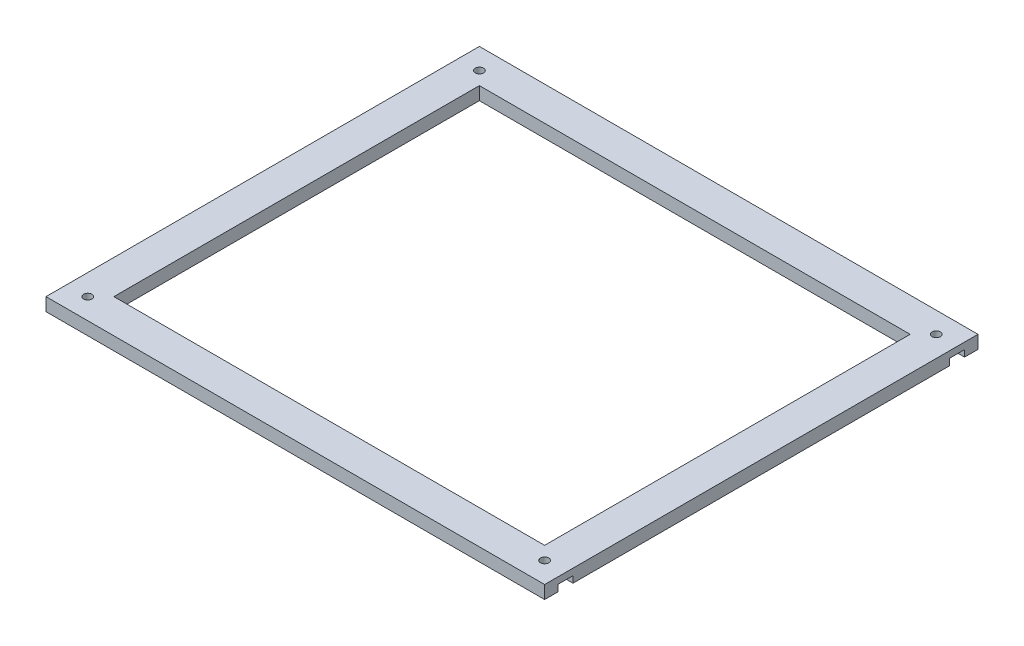
ISO-10303-21;
HEADER;
FILE_DESCRIPTION(('STEP AP214'),'2;1');
FILE_NAME('part.step','',(''),(''),'','','');
FILE_SCHEMA(('AUTOMOTIVE_DESIGN { 1 0 10303 214 1 1 1 1 }'));
ENDSEC;
DATA;
#1=APPLICATION_CONTEXT('core data for automotive mechanical design processes');
#2=APPLICATION_PROTOCOL_DEFINITION('international standard','automotive_design',2000,#1);
#3=PRODUCT_CONTEXT('',#1,'mechanical');
#4=PRODUCT('Part','Part','',(#3));
#5=PRODUCT_RELATED_PRODUCT_CATEGORY('part','',(#4));
#6=PRODUCT_DEFINITION_FORMATION('','',#4);
#7=PRODUCT_DEFINITION_CONTEXT('part definition',#1,'design');
#8=PRODUCT_DEFINITION('design','',#6,#7);
#9=PRODUCT_DEFINITION_SHAPE('','',#8);
#10=(LENGTH_UNIT() NAMED_UNIT(*) SI_UNIT(.MILLI.,.METRE.));
#11=(NAMED_UNIT(*) PLANE_ANGLE_UNIT() SI_UNIT($,.RADIAN.));
#12=(NAMED_UNIT(*) SI_UNIT($,.STERADIAN.) SOLID_ANGLE_UNIT());
#13=UNCERTAINTY_MEASURE_WITH_UNIT(LENGTH_MEASURE(1.E-05),#10,'distance_accuracy_value','');
#14=(GEOMETRIC_REPRESENTATION_CONTEXT(3) GLOBAL_UNCERTAINTY_ASSIGNED_CONTEXT((#13)) GLOBAL_UNIT_ASSIGNED_CONTEXT((#10,
#11,#12)) REPRESENTATION_CONTEXT('',''));
#15=CARTESIAN_POINT('',(0.,0.,0.));
#16=DIRECTION('',(0.,0.,1.));
#17=DIRECTION('',(1.,0.,0.));
#18=AXIS2_PLACEMENT_3D('',#15,#16,#17);
#19=CARTESIAN_POINT('',(1.31318109767508E-12,-5.,77.8499999999986));
#20=DIRECTION('',(0.,0.,-1.));
#21=DIRECTION('',(-1.,0.,0.));
#22=AXIS2_PLACEMENT_3D('',#19,#20,#21);
#23=PLANE('',#22);
#24=DIRECTION('',(0.,1.,0.));
#25=VECTOR('',#24,1.);
#26=CARTESIAN_POINT('',(-95.5,-5.,77.85));
#27=LINE('',#26,#25);
#28=CARTESIAN_POINT('',(-95.5,-5.,77.85));
#29=VERTEX_POINT('',#28);
#30=CARTESIAN_POINT('',(-95.5,-2.5,77.85));
#31=VERTEX_POINT('',#30);
#32=EDGE_CURVE('E50',#29,#31,#27,.T.);
#33=ORIENTED_EDGE('',*,*,#32,.T.);
#34=DIRECTION('',(-1.,0.,0.));
#35=VECTOR('',#34,1.);
#36=CARTESIAN_POINT('',(1.31318109767508E-12,-2.5,77.8499999999986));
#37=LINE('',#36,#35);
#38=CARTESIAN_POINT('',(-85.8545517328096,-2.5,77.85));
#39=VERTEX_POINT('',#38);
#40=EDGE_CURVE('E238',#39,#31,#37,.T.);
#41=ORIENTED_EDGE('',*,*,#40,.F.);
#42=DIRECTION('',(0.,1.,0.));
#43=VECTOR('',#42,1.);
#44=CARTESIAN_POINT('',(-85.8545517328096,-5.,77.85));
#45=LINE('',#44,#43);
#46=CARTESIAN_POINT('',(-85.8545517328096,-5.,77.85));
#47=VERTEX_POINT('',#46);
#48=EDGE_CURVE('E392',#47,#39,#45,.T.);
#49=ORIENTED_EDGE('',*,*,#48,.F.);
#50=DIRECTION('',(-1.,0.,0.));
#51=VECTOR('',#50,1.);
#52=CARTESIAN_POINT('',(1.31318109767508E-12,-5.,77.8499999999986));
#53=LINE('',#52,#51);
#54=EDGE_CURVE('E381',#47,#29,#53,.T.);
#55=ORIENTED_EDGE('',*,*,#54,.T.);
#56=EDGE_LOOP('',(#33,#41,#49,#55));
#57=FACE_BOUND('',#56,.T.);
#58=ADVANCED_FACE('F47',(#57),#23,.T.);
#59=CARTESIAN_POINT('',(-30.6808749572977,-5.,-17.7136114155692));
#60=DIRECTION('',(-0.866025403784438,0.,-0.500000000000002));
#61=DIRECTION('',(-0.500000000000002,0.,0.866025403784438));
#62=AXIS2_PLACEMENT_3D('',#59,#60,#61);
#63=PLANE('',#62);
#64=ORIENTED_EDGE('',*,*,#48,.T.);
#65=DIRECTION('',(-0.500000000000002,0.,0.866025403784438));
#66=VECTOR('',#65,1.);
#67=CARTESIAN_POINT('',(-30.6808749572977,-2.5,-17.7136114155692));
#68=LINE('',#67,#66);
#69=CARTESIAN_POINT('',(-84.2091034656192,-2.5,75.));
#70=VERTEX_POINT('',#69);
#71=EDGE_CURVE('E409',#70,#39,#68,.T.);
#72=ORIENTED_EDGE('',*,*,#71,.F.);
#73=DIRECTION('',(0.,1.,0.));
#74=VECTOR('',#73,1.);
#75=CARTESIAN_POINT('',(-84.2091034656192,-5.,75.));
#76=LINE('',#75,#74);
#77=CARTESIAN_POINT('',(-84.2091034656192,-5.,75.));
#78=VERTEX_POINT('',#77);
#79=EDGE_CURVE('E262',#78,#70,#76,.T.);
#80=ORIENTED_EDGE('',*,*,#79,.F.);
#81=DIRECTION('',(-0.500000000000002,0.,0.866025403784438));
#82=VECTOR('',#81,1.);
#83=CARTESIAN_POINT('',(-30.6808749572977,-5.,-17.7136114155692));
#84=LINE('',#83,#82);
#85=EDGE_CURVE('E408',#78,#47,#84,.T.);
#86=ORIENTED_EDGE('',*,*,#85,.T.);
#87=EDGE_LOOP('',(#64,#72,#80,#86));
#88=FACE_BOUND('',#87,.T.);
#89=ADVANCED_FACE('F407',(#88),#63,.T.);
#90=CARTESIAN_POINT('',(-95.6327802411308,-5.,55.2136114155692));
#91=DIRECTION('',(-0.866025403784438,0.,0.5));
#92=DIRECTION('',(0.5,0.,0.866025403784438));
#93=AXIS2_PLACEMENT_3D('',#90,#91,#92);
#94=PLANE('',#93);
#95=ORIENTED_EDGE('',*,*,#79,.T.);
#96=DIRECTION('',(0.5,0.,0.866025403784438));
#97=VECTOR('',#96,1.);
#98=CARTESIAN_POINT('',(-95.6327802411308,-2.5,55.2136114155692));
#99=LINE('',#98,#97);
#100=CARTESIAN_POINT('',(-85.8545517328096,-2.5,72.15));
#101=VERTEX_POINT('',#100);
#102=EDGE_CURVE('E400',#101,#70,#99,.T.);
#103=ORIENTED_EDGE('',*,*,#102,.F.);
#104=DIRECTION('',(0.,1.,0.));
#105=VECTOR('',#104,1.);
#106=CARTESIAN_POINT('',(-85.8545517328096,-5.,72.15));
#107=LINE('',#106,#105);
#108=CARTESIAN_POINT('',(-85.8545517328096,-5.,72.15));
#109=VERTEX_POINT('',#108);
#110=EDGE_CURVE('E251',#109,#101,#107,.T.);
#111=ORIENTED_EDGE('',*,*,#110,.F.);
#112=DIRECTION('',(0.5,0.,0.866025403784438));
#113=VECTOR('',#112,1.);
#114=CARTESIAN_POINT('',(-95.6327802411308,-5.,55.2136114155692));
#115=LINE('',#114,#113);
#116=EDGE_CURVE('E402',#109,#78,#115,.T.);
#117=ORIENTED_EDGE('',*,*,#116,.T.);
#118=EDGE_LOOP('',(#95,#103,#111,#117));
#119=FACE_BOUND('',#118,.T.);
#120=ADVANCED_FACE('F399',(#119),#94,.T.);
#121=CARTESIAN_POINT('',(0.,-5.,72.15));
#122=DIRECTION('',(0.,0.,-1.));
#123=DIRECTION('',(-1.,0.,0.));
#124=AXIS2_PLACEMENT_3D('',#121,#122,#123);
#125=PLANE('',#124);
#126=DIRECTION('',(1.,0.,0.));
#127=VECTOR('',#126,1.);
#128=CARTESIAN_POINT('',(0.,-2.5,72.15));
#129=LINE('',#128,#127);
#130=CARTESIAN_POINT('',(-95.5,-2.5,72.15));
#131=VERTEX_POINT('',#130);
#132=EDGE_CURVE('E235',#131,#101,#129,.T.);
#133=ORIENTED_EDGE('',*,*,#132,.F.);
#134=DIRECTION('',(0.,1.,0.));
#135=VECTOR('',#134,1.);
#136=CARTESIAN_POINT('',(-95.5,-5.,72.15));
#137=LINE('',#136,#135);
#138=CARTESIAN_POINT('',(-95.5,-5.,72.15));
#139=VERTEX_POINT('',#138);
#140=EDGE_CURVE('E249',#139,#131,#137,.T.);
#141=ORIENTED_EDGE('',*,*,#140,.F.);
#142=DIRECTION('',(-1.,0.,0.));
#143=VECTOR('',#142,1.);
#144=CARTESIAN_POINT('',(0.,-5.,72.15));
#145=LINE('',#144,#143);
#146=EDGE_CURVE('E559',#109,#139,#145,.T.);
#147=ORIENTED_EDGE('',*,*,#146,.F.);
#148=ORIENTED_EDGE('',*,*,#110,.T.);
#149=EDGE_LOOP('',(#133,#141,#147,#148));
#150=FACE_BOUND('',#149,.T.);
#151=ADVANCED_FACE('F247',(#150),#125,.F.);
#152=CARTESIAN_POINT('',(0.,-5.,-72.15));
#153=DIRECTION('',(0.,0.,1.));
#154=DIRECTION('',(1.,0.,0.));
#155=AXIS2_PLACEMENT_3D('',#152,#153,#154);
#156=PLANE('',#155);
#157=DIRECTION('',(1.,0.,0.));
#158=VECTOR('',#157,1.);
#159=CARTESIAN_POINT('',(0.,-2.5,-72.15));
#160=LINE('',#159,#158);
#161=CARTESIAN_POINT('',(-95.5,-2.5,-72.15));
#162=VERTEX_POINT('',#161);
#163=CARTESIAN_POINT('',(-85.8545517328096,-2.5,-72.15));
#164=VERTEX_POINT('',#163);
#165=EDGE_CURVE('E68',#162,#164,#160,.T.);
#166=ORIENTED_EDGE('',*,*,#165,.T.);
#167=DIRECTION('',(0.,1.,0.));
#168=VECTOR('',#167,1.);
#169=CARTESIAN_POINT('',(-85.8545517328096,-5.,-72.15));
#170=LINE('',#169,#168);
#171=CARTESIAN_POINT('',(-85.8545517328096,-5.,-72.15));
#172=VERTEX_POINT('',#171);
#173=EDGE_CURVE('E264',#172,#164,#170,.T.);
#174=ORIENTED_EDGE('',*,*,#173,.F.);
#175=DIRECTION('',(1.,0.,0.));
#176=VECTOR('',#175,1.);
#177=CARTESIAN_POINT('',(0.,-5.,-72.15));
#178=LINE('',#177,#176);
#179=CARTESIAN_POINT('',(-95.5,-5.,-72.15));
#180=VERTEX_POINT('',#179);
#181=EDGE_CURVE('E554',#180,#172,#178,.T.);
#182=ORIENTED_EDGE('',*,*,#181,.F.);
#183=DIRECTION('',(0.,1.,0.));
#184=VECTOR('',#183,1.);
#185=CARTESIAN_POINT('',(-95.5,-5.,-72.15));
#186=LINE('',#185,#184);
#187=EDGE_CURVE('E64',#180,#162,#186,.T.);
#188=ORIENTED_EDGE('',*,*,#187,.T.);
#189=EDGE_LOOP('',(#166,#174,#182,#188));
#190=FACE_BOUND('',#189,.T.);
#191=ADVANCED_FACE('F614',(#190),#156,.F.);
#192=CARTESIAN_POINT('',(-95.6327802411308,-5.,-55.2136114155692));
#193=DIRECTION('',(0.866025403784438,0.,0.5));
#194=DIRECTION('',(0.5,0.,-0.866025403784438));
#195=AXIS2_PLACEMENT_3D('',#192,#193,#194);
#196=PLANE('',#195);
#197=DIRECTION('',(0.5,0.,-0.866025403784438));
#198=VECTOR('',#197,1.);
#199=CARTESIAN_POINT('',(-95.6327802411308,-2.5,-55.2136114155692));
#200=LINE('',#199,#198);
#201=CARTESIAN_POINT('',(-84.2091034656192,-2.5,-75.));
#202=VERTEX_POINT('',#201);
#203=EDGE_CURVE('E485',#164,#202,#200,.T.);
#204=ORIENTED_EDGE('',*,*,#203,.T.);
#205=DIRECTION('',(0.,1.,0.));
#206=VECTOR('',#205,1.);
#207=CARTESIAN_POINT('',(-84.2091034656192,-5.,-75.));
#208=LINE('',#207,#206);
#209=CARTESIAN_POINT('',(-84.2091034656192,-5.,-75.));
#210=VERTEX_POINT('',#209);
#211=EDGE_CURVE('E270',#210,#202,#208,.T.);
#212=ORIENTED_EDGE('',*,*,#211,.F.);
#213=DIRECTION('',(0.5,0.,-0.866025403784438));
#214=VECTOR('',#213,1.);
#215=CARTESIAN_POINT('',(-95.6327802411308,-5.,-55.2136114155692));
#216=LINE('',#215,#214);
#217=EDGE_CURVE('E551',#172,#210,#216,.T.);
#218=ORIENTED_EDGE('',*,*,#217,.F.);
#219=ORIENTED_EDGE('',*,*,#173,.T.);
#220=EDGE_LOOP('',(#204,#212,#218,#219));
#221=FACE_BOUND('',#220,.T.);
#222=ADVANCED_FACE('F618',(#221),#196,.F.);
#223=CARTESIAN_POINT('',(-30.6808749572977,-5.,17.7136114155692));
#224=DIRECTION('',(0.866025403784438,0.,-0.500000000000002));
#225=DIRECTION('',(-0.500000000000002,0.,-0.866025403784438));
#226=AXIS2_PLACEMENT_3D('',#223,#224,#225);
#227=PLANE('',#226);
#228=DIRECTION('',(-0.500000000000002,0.,-0.866025403784438));
#229=VECTOR('',#228,1.);
#230=CARTESIAN_POINT('',(-30.6808749572977,-2.5,17.7136114155692));
#231=LINE('',#230,#229);
#232=CARTESIAN_POINT('',(-85.8545517328096,-2.5,-77.85));
#233=VERTEX_POINT('',#232);
#234=EDGE_CURVE('E358',#202,#233,#231,.T.);
#235=ORIENTED_EDGE('',*,*,#234,.T.);
#236=DIRECTION('',(0.,1.,0.));
#237=VECTOR('',#236,1.);
#238=CARTESIAN_POINT('',(-85.8545517328096,-5.,-77.85));
#239=LINE('',#238,#237);
#240=CARTESIAN_POINT('',(-85.8545517328096,-5.,-77.85));
#241=VERTEX_POINT('',#240);
#242=EDGE_CURVE('E274',#241,#233,#239,.T.);
#243=ORIENTED_EDGE('',*,*,#242,.F.);
#244=DIRECTION('',(-0.500000000000002,0.,-0.866025403784438));
#245=VECTOR('',#244,1.);
#246=CARTESIAN_POINT('',(-30.6808749572977,-5.,17.7136114155692));
#247=LINE('',#246,#245);
#248=EDGE_CURVE('E548',#210,#241,#247,.T.);
#249=ORIENTED_EDGE('',*,*,#248,.F.);
#250=ORIENTED_EDGE('',*,*,#211,.T.);
#251=EDGE_LOOP('',(#235,#243,#249,#250));
#252=FACE_BOUND('',#251,.T.);
#253=ADVANCED_FACE('F621',(#252),#227,.F.);
#254=CARTESIAN_POINT('',(0.,-5.,-77.85));
#255=DIRECTION('',(0.,0.,-1.));
#256=DIRECTION('',(-1.,0.,0.));
#257=AXIS2_PLACEMENT_3D('',#254,#255,#256);
#258=PLANE('',#257);
#259=DIRECTION('',(-1.,0.,0.));
#260=VECTOR('',#259,1.);
#261=CARTESIAN_POINT('',(0.,-2.5,-77.85));
#262=LINE('',#261,#260);
#263=CARTESIAN_POINT('',(-95.5,-2.5,-77.85));
#264=VERTEX_POINT('',#263);
#265=EDGE_CURVE('E476',#233,#264,#262,.T.);
#266=ORIENTED_EDGE('',*,*,#265,.T.);
#267=DIRECTION('',(0.,1.,0.));
#268=VECTOR('',#267,1.);
#269=CARTESIAN_POINT('',(-95.5,-5.,-77.85));
#270=LINE('',#269,#268);
#271=CARTESIAN_POINT('',(-95.5,-5.,-77.85));
#272=VERTEX_POINT('',#271);
#273=EDGE_CURVE('E278',#272,#264,#270,.T.);
#274=ORIENTED_EDGE('',*,*,#273,.F.);
#275=DIRECTION('',(-1.,0.,0.));
#276=VECTOR('',#275,1.);
#277=CARTESIAN_POINT('',(0.,-5.,-77.85));
#278=LINE('',#277,#276);
#279=EDGE_CURVE('E545',#241,#272,#278,.T.);
#280=ORIENTED_EDGE('',*,*,#279,.F.);
#281=ORIENTED_EDGE('',*,*,#242,.T.);
#282=EDGE_LOOP('',(#266,#274,#280,#281));
#283=FACE_BOUND('',#282,.T.);
#284=ADVANCED_FACE('F625',(#283),#258,.F.);
#285=CARTESIAN_POINT('',(0.,-5.,-77.85));
#286=DIRECTION('',(0.,0.,1.));
#287=DIRECTION('',(1.,0.,0.));
#288=AXIS2_PLACEMENT_3D('',#285,#286,#287);
#289=PLANE('',#288);
#290=DIRECTION('',(0.,1.,0.));
#291=VECTOR('',#290,1.);
#292=CARTESIAN_POINT('',(95.5,-5.,-77.85));
#293=LINE('',#292,#291);
#294=CARTESIAN_POINT('',(95.5,-5.,-77.85));
#295=VERTEX_POINT('',#294);
#296=CARTESIAN_POINT('',(95.5,-2.5,-77.85));
#297=VERTEX_POINT('',#296);
#298=EDGE_CURVE('E290',#295,#297,#293,.T.);
#299=ORIENTED_EDGE('',*,*,#298,.T.);
#300=DIRECTION('',(1.,0.,0.));
#301=VECTOR('',#300,1.);
#302=CARTESIAN_POINT('',(0.,-2.5,-77.85));
#303=LINE('',#302,#301);
#304=CARTESIAN_POINT('',(85.8545517328096,-2.5,-77.85));
#305=VERTEX_POINT('',#304);
#306=EDGE_CURVE('E457',#305,#297,#303,.T.);
#307=ORIENTED_EDGE('',*,*,#306,.F.);
#308=DIRECTION('',(0.,1.,0.));
#309=VECTOR('',#308,1.);
#310=CARTESIAN_POINT('',(85.8545517328096,-5.,-77.85));
#311=LINE('',#310,#309);
#312=CARTESIAN_POINT('',(85.8545517328096,-5.,-77.85));
#313=VERTEX_POINT('',#312);
#314=EDGE_CURVE('E294',#313,#305,#311,.T.);
#315=ORIENTED_EDGE('',*,*,#314,.F.);
#316=DIRECTION('',(1.,0.,0.));
#317=VECTOR('',#316,1.);
#318=CARTESIAN_POINT('',(0.,-5.,-77.85));
#319=LINE('',#318,#317);
#320=EDGE_CURVE('E531',#313,#295,#319,.T.);
#321=ORIENTED_EDGE('',*,*,#320,.T.);
#322=EDGE_LOOP('',(#299,#307,#315,#321));
#323=FACE_BOUND('',#322,.T.);
#324=ADVANCED_FACE('F629',(#323),#289,.T.);
#325=CARTESIAN_POINT('',(30.6808749572979,-5.,17.7136114155692));
#326=DIRECTION('',(0.866025403784439,0.,0.5));
#327=DIRECTION('',(0.5,0.,-0.866025403784439));
#328=AXIS2_PLACEMENT_3D('',#325,#326,#327);
#329=PLANE('',#328);
#330=ORIENTED_EDGE('',*,*,#314,.T.);
#331=DIRECTION('',(0.5,0.,-0.866025403784439));
#332=VECTOR('',#331,1.);
#333=CARTESIAN_POINT('',(30.6808749572979,-2.5,17.7136114155692));
#334=LINE('',#333,#332);
#335=CARTESIAN_POINT('',(84.2091034656192,-2.5,-75.));
#336=VERTEX_POINT('',#335);
#337=EDGE_CURVE('E460',#336,#305,#334,.T.);
#338=ORIENTED_EDGE('',*,*,#337,.F.);
#339=DIRECTION('',(0.,1.,0.));
#340=VECTOR('',#339,1.);
#341=CARTESIAN_POINT('',(84.2091034656192,-5.,-75.));
#342=LINE('',#341,#340);
#343=CARTESIAN_POINT('',(84.2091034656192,-5.,-75.));
#344=VERTEX_POINT('',#343);
#345=EDGE_CURVE('E298',#344,#336,#342,.T.);
#346=ORIENTED_EDGE('',*,*,#345,.F.);
#347=DIRECTION('',(0.5,0.,-0.866025403784439));
#348=VECTOR('',#347,1.);
#349=CARTESIAN_POINT('',(30.6808749572979,-5.,17.7136114155692));
#350=LINE('',#349,#348);
#351=EDGE_CURVE('E527',#344,#313,#350,.T.);
#352=ORIENTED_EDGE('',*,*,#351,.T.);
#353=EDGE_LOOP('',(#330,#338,#346,#352));
#354=FACE_BOUND('',#353,.T.);
#355=ADVANCED_FACE('F640',(#354),#329,.T.);
#356=CARTESIAN_POINT('',(95.6327802411307,-5.,-55.2136114155695));
#357=DIRECTION('',(0.866025403784437,0.,-0.500000000000002));
#358=DIRECTION('',(-0.500000000000002,0.,-0.866025403784437));
#359=AXIS2_PLACEMENT_3D('',#356,#357,#358);
#360=PLANE('',#359);
#361=ORIENTED_EDGE('',*,*,#345,.T.);
#362=DIRECTION('',(-0.500000000000002,0.,-0.866025403784437));
#363=VECTOR('',#362,1.);
#364=CARTESIAN_POINT('',(95.6327802411307,-2.5,-55.2136114155695));
#365=LINE('',#364,#363);
#366=CARTESIAN_POINT('',(85.8545517328096,-2.5,-72.15));
#367=VERTEX_POINT('',#366);
#368=EDGE_CURVE('E463',#367,#336,#365,.T.);
#369=ORIENTED_EDGE('',*,*,#368,.F.);
#370=DIRECTION('',(0.,1.,0.));
#371=VECTOR('',#370,1.);
#372=CARTESIAN_POINT('',(85.8545517328096,-5.,-72.15));
#373=LINE('',#372,#371);
#374=CARTESIAN_POINT('',(85.8545517328096,-5.,-72.15));
#375=VERTEX_POINT('',#374);
#376=EDGE_CURVE('E302',#375,#367,#373,.T.);
#377=ORIENTED_EDGE('',*,*,#376,.F.);
#378=DIRECTION('',(-0.500000000000002,0.,-0.866025403784437));
#379=VECTOR('',#378,1.);
#380=CARTESIAN_POINT('',(95.6327802411307,-5.,-55.2136114155695));
#381=LINE('',#380,#379);
#382=EDGE_CURVE('E523',#375,#344,#381,.T.);
#383=ORIENTED_EDGE('',*,*,#382,.T.);
#384=EDGE_LOOP('',(#361,#369,#377,#383));
#385=FACE_BOUND('',#384,.T.);
#386=ADVANCED_FACE('F644',(#385),#360,.T.);
#387=CARTESIAN_POINT('',(0.,-5.,-72.15));
#388=DIRECTION('',(0.,0.,1.));
#389=DIRECTION('',(1.,0.,0.));
#390=AXIS2_PLACEMENT_3D('',#387,#388,#389);
#391=PLANE('',#390);
#392=DIRECTION('',(-1.,0.,0.));
#393=VECTOR('',#392,1.);
#394=CARTESIAN_POINT('',(0.,-2.5,-72.15));
#395=LINE('',#394,#393);
#396=CARTESIAN_POINT('',(95.5,-2.5,-72.15));
#397=VERTEX_POINT('',#396);
#398=EDGE_CURVE('E450',#397,#367,#395,.T.);
#399=ORIENTED_EDGE('',*,*,#398,.F.);
#400=DIRECTION('',(0.,1.,0.));
#401=VECTOR('',#400,1.);
#402=CARTESIAN_POINT('',(95.5,-5.,-72.15));
#403=LINE('',#402,#401);
#404=CARTESIAN_POINT('',(95.5,-5.,-72.15));
#405=VERTEX_POINT('',#404);
#406=EDGE_CURVE('E306',#405,#397,#403,.T.);
#407=ORIENTED_EDGE('',*,*,#406,.F.);
#408=DIRECTION('',(1.,0.,0.));
#409=VECTOR('',#408,1.);
#410=CARTESIAN_POINT('',(0.,-5.,-72.15));
#411=LINE('',#410,#409);
#412=EDGE_CURVE('E520',#375,#405,#411,.T.);
#413=ORIENTED_EDGE('',*,*,#412,.F.);
#414=ORIENTED_EDGE('',*,*,#376,.T.);
#415=EDGE_LOOP('',(#399,#407,#413,#414));
#416=FACE_BOUND('',#415,.T.);
#417=ADVANCED_FACE('F648',(#416),#391,.F.);
#418=CARTESIAN_POINT('',(0.,-5.,72.15));
#419=DIRECTION('',(0.,0.,-1.));
#420=DIRECTION('',(-1.,0.,0.));
#421=AXIS2_PLACEMENT_3D('',#418,#419,#420);
#422=PLANE('',#421);
#423=DIRECTION('',(-1.,0.,0.));
#424=VECTOR('',#423,1.);
#425=CARTESIAN_POINT('',(0.,-2.5,72.15));
#426=LINE('',#425,#424);
#427=CARTESIAN_POINT('',(95.5,-2.5,72.15));
#428=VERTEX_POINT('',#427);
#429=CARTESIAN_POINT('',(85.8545517328096,-2.5,72.15));
#430=VERTEX_POINT('',#429);
#431=EDGE_CURVE('E438',#428,#430,#426,.T.);
#432=ORIENTED_EDGE('',*,*,#431,.T.);
#433=DIRECTION('',(0.,1.,0.));
#434=VECTOR('',#433,1.);
#435=CARTESIAN_POINT('',(85.8545517328096,-5.,72.15));
#436=LINE('',#435,#434);
#437=CARTESIAN_POINT('',(85.8545517328096,-5.,72.15));
#438=VERTEX_POINT('',#437);
#439=EDGE_CURVE('E313',#438,#430,#436,.T.);
#440=ORIENTED_EDGE('',*,*,#439,.F.);
#441=DIRECTION('',(-1.,0.,0.));
#442=VECTOR('',#441,1.);
#443=CARTESIAN_POINT('',(0.,-5.,72.15));
#444=LINE('',#443,#442);
#445=CARTESIAN_POINT('',(95.5,-5.,72.15));
#446=VERTEX_POINT('',#445);
#447=EDGE_CURVE('E514',#446,#438,#444,.T.);
#448=ORIENTED_EDGE('',*,*,#447,.F.);
#449=DIRECTION('',(0.,1.,0.));
#450=VECTOR('',#449,1.);
#451=CARTESIAN_POINT('',(95.5,-5.,72.15));
#452=LINE('',#451,#450);
#453=EDGE_CURVE('E310',#446,#428,#452,.T.);
#454=ORIENTED_EDGE('',*,*,#453,.T.);
#455=EDGE_LOOP('',(#432,#440,#448,#454));
#456=FACE_BOUND('',#455,.T.);
#457=ADVANCED_FACE('F652',(#456),#422,.F.);
#458=CARTESIAN_POINT('',(95.6327802411307,-5.,55.2136114155695));
#459=DIRECTION('',(-0.866025403784437,0.,-0.500000000000002));
#460=DIRECTION('',(-0.500000000000002,0.,0.866025403784437));
#461=AXIS2_PLACEMENT_3D('',#458,#459,#460);
#462=PLANE('',#461);
#463=DIRECTION('',(-0.500000000000002,0.,0.866025403784437));
#464=VECTOR('',#463,1.);
#465=CARTESIAN_POINT('',(95.6327802411307,-2.5,55.2136114155695));
#466=LINE('',#465,#464);
#467=CARTESIAN_POINT('',(84.2091034656192,-2.5,75.));
#468=VERTEX_POINT('',#467);
#469=EDGE_CURVE('E441',#430,#468,#466,.T.);
#470=ORIENTED_EDGE('',*,*,#469,.T.);
#471=DIRECTION('',(0.,1.,0.));
#472=VECTOR('',#471,1.);
#473=CARTESIAN_POINT('',(84.2091034656192,-5.,75.));
#474=LINE('',#473,#472);
#475=CARTESIAN_POINT('',(84.2091034656192,-5.,75.));
#476=VERTEX_POINT('',#475);
#477=EDGE_CURVE('E317',#476,#468,#474,.T.);
#478=ORIENTED_EDGE('',*,*,#477,.F.);
#479=DIRECTION('',(-0.500000000000002,0.,0.866025403784437));
#480=VECTOR('',#479,1.);
#481=CARTESIAN_POINT('',(95.6327802411307,-5.,55.2136114155695));
#482=LINE('',#481,#480);
#483=EDGE_CURVE('E511',#438,#476,#482,.T.);
#484=ORIENTED_EDGE('',*,*,#483,.F.);
#485=ORIENTED_EDGE('',*,*,#439,.T.);
#486=EDGE_LOOP('',(#470,#478,#484,#485));
#487=FACE_BOUND('',#486,.T.);
#488=ADVANCED_FACE('F656',(#487),#462,.F.);
#489=CARTESIAN_POINT('',(30.6808749572979,-5.,-17.7136114155692));
#490=DIRECTION('',(-0.866025403784439,0.,0.5));
#491=DIRECTION('',(0.5,0.,0.866025403784439));
#492=AXIS2_PLACEMENT_3D('',#489,#490,#491);
#493=PLANE('',#492);
#494=DIRECTION('',(0.5,0.,0.866025403784439));
#495=VECTOR('',#494,1.);
#496=CARTESIAN_POINT('',(30.6808749572979,-2.5,-17.7136114155692));
#497=LINE('',#496,#495);
#498=CARTESIAN_POINT('',(85.8545517328096,-2.5,77.85));
#499=VERTEX_POINT('',#498);
#500=EDGE_CURVE('E425',#468,#499,#497,.T.);
#501=ORIENTED_EDGE('',*,*,#500,.T.);
#502=DIRECTION('',(0.,1.,0.));
#503=VECTOR('',#502,1.);
#504=CARTESIAN_POINT('',(85.8545517328096,-5.,77.85));
#505=LINE('',#504,#503);
#506=CARTESIAN_POINT('',(85.8545517328096,-5.,77.85));
#507=VERTEX_POINT('',#506);
#508=EDGE_CURVE('E321',#507,#499,#505,.T.);
#509=ORIENTED_EDGE('',*,*,#508,.F.);
#510=DIRECTION('',(0.5,0.,0.866025403784439));
#511=VECTOR('',#510,1.);
#512=CARTESIAN_POINT('',(30.6808749572979,-5.,-17.7136114155692));
#513=LINE('',#512,#511);
#514=EDGE_CURVE('E508',#476,#507,#513,.T.);
#515=ORIENTED_EDGE('',*,*,#514,.F.);
#516=ORIENTED_EDGE('',*,*,#477,.T.);
#517=EDGE_LOOP('',(#501,#509,#515,#516));
#518=FACE_BOUND('',#517,.T.);
#519=ADVANCED_FACE('F660',(#518),#493,.F.);
#520=CARTESIAN_POINT('',(0.,-5.,77.85));
#521=DIRECTION('',(0.,0.,1.));
#522=DIRECTION('',(1.,0.,0.));
#523=AXIS2_PLACEMENT_3D('',#520,#521,#522);
#524=PLANE('',#523);
#525=DIRECTION('',(1.,0.,0.));
#526=VECTOR('',#525,1.);
#527=CARTESIAN_POINT('',(0.,-2.5,77.85));
#528=LINE('',#527,#526);
#529=CARTESIAN_POINT('',(95.5,-2.5,77.85));
#530=VERTEX_POINT('',#529);
#531=EDGE_CURVE('E430',#499,#530,#528,.T.);
#532=ORIENTED_EDGE('',*,*,#531,.T.);
#533=DIRECTION('',(0.,1.,0.));
#534=VECTOR('',#533,1.);
#535=CARTESIAN_POINT('',(95.5,-5.,77.85));
#536=LINE('',#535,#534);
#537=CARTESIAN_POINT('',(95.5,-5.,77.85));
#538=VERTEX_POINT('',#537);
#539=EDGE_CURVE('E325',#538,#530,#536,.T.);
#540=ORIENTED_EDGE('',*,*,#539,.F.);
#541=DIRECTION('',(1.,0.,0.));
#542=VECTOR('',#541,1.);
#543=CARTESIAN_POINT('',(0.,-5.,77.85));
#544=LINE('',#543,#542);
#545=EDGE_CURVE('E505',#507,#538,#544,.T.);
#546=ORIENTED_EDGE('',*,*,#545,.F.);
#547=ORIENTED_EDGE('',*,*,#508,.T.);
#548=EDGE_LOOP('',(#532,#540,#546,#547));
#549=FACE_BOUND('',#548,.T.);
#550=ADVANCED_FACE('F664',(#549),#524,.F.);
#551=CARTESIAN_POINT('',(82.5,-5.,0.));
#552=DIRECTION('',(1.,0.,0.));
#553=DIRECTION('',(0.,0.,-1.));
#554=AXIS2_PLACEMENT_3D('',#551,#552,#553);
#555=PLANE('',#554);
#556=DIRECTION('',(0.,0.,-1.));
#557=VECTOR('',#556,1.);
#558=CARTESIAN_POINT('',(82.5,0.,0.));
#559=LINE('',#558,#557);
#560=CARTESIAN_POINT('',(82.5,0.,70.));
#561=VERTEX_POINT('',#560);
#562=CARTESIAN_POINT('',(82.5,0.,-70.));
#563=VERTEX_POINT('',#562);
#564=EDGE_CURVE('E367',#561,#563,#559,.T.);
#565=ORIENTED_EDGE('',*,*,#564,.T.);
#566=DIRECTION('',(0.,1.,0.));
#567=VECTOR('',#566,1.);
#568=CARTESIAN_POINT('',(82.5,-5.,-70.));
#569=LINE('',#568,#567);
#570=CARTESIAN_POINT('',(82.5,-5.,-70.));
#571=VERTEX_POINT('',#570);
#572=EDGE_CURVE('E11',#571,#563,#569,.T.);
#573=ORIENTED_EDGE('',*,*,#572,.F.);
#574=DIRECTION('',(0.,0.,-1.));
#575=VECTOR('',#574,1.);
#576=CARTESIAN_POINT('',(82.5,-5.,0.));
#577=LINE('',#576,#575);
#578=CARTESIAN_POINT('',(82.5,-5.,70.));
#579=VERTEX_POINT('',#578);
#580=EDGE_CURVE('E566',#579,#571,#577,.T.);
#581=ORIENTED_EDGE('',*,*,#580,.F.);
#582=DIRECTION('',(0.,1.,0.));
#583=VECTOR('',#582,1.);
#584=CARTESIAN_POINT('',(82.5,-5.,70.));
#585=LINE('',#584,#583);
#586=EDGE_CURVE('E388',#579,#561,#585,.T.);
#587=ORIENTED_EDGE('',*,*,#586,.T.);
#588=EDGE_LOOP('',(#565,#573,#581,#587));
#589=FACE_BOUND('',#588,.T.);
#590=ADVANCED_FACE('F581',(#589),#555,.F.);
#591=CARTESIAN_POINT('',(0.,-5.,-70.));
#592=DIRECTION('',(0.,0.,1.));
#593=DIRECTION('',(1.,0.,0.));
#594=AXIS2_PLACEMENT_3D('',#591,#592,#593);
#595=PLANE('',#594);
#596=DIRECTION('',(1.,0.,0.));
#597=VECTOR('',#596,1.);
#598=CARTESIAN_POINT('',(0.,0.,-70.));
#599=LINE('',#598,#597);
#600=CARTESIAN_POINT('',(-82.5,0.,-70.));
#601=VERTEX_POINT('',#600);
#602=EDGE_CURVE('E378',#601,#563,#599,.T.);
#603=ORIENTED_EDGE('',*,*,#602,.F.);
#604=DIRECTION('',(0.,1.,0.));
#605=VECTOR('',#604,1.);
#606=CARTESIAN_POINT('',(-82.5,-5.,-70.));
#607=LINE('',#606,#605);
#608=CARTESIAN_POINT('',(-82.5,-5.,-70.));
#609=VERTEX_POINT('',#608);
#610=EDGE_CURVE('E56',#609,#601,#607,.T.);
#611=ORIENTED_EDGE('',*,*,#610,.F.);
#612=DIRECTION('',(1.,0.,0.));
#613=VECTOR('',#612,1.);
#614=CARTESIAN_POINT('',(0.,-5.,-70.));
#615=LINE('',#614,#613);
#616=EDGE_CURVE('E338',#609,#571,#615,.T.);
#617=ORIENTED_EDGE('',*,*,#616,.T.);
#618=ORIENTED_EDGE('',*,*,#572,.T.);
#619=EDGE_LOOP('',(#603,#611,#617,#618));
#620=FACE_BOUND('',#619,.T.);
#621=ADVANCED_FACE('F583',(#620),#595,.T.);
#622=CARTESIAN_POINT('',(-82.5,-5.,0.));
#623=DIRECTION('',(1.,0.,0.));
#624=DIRECTION('',(0.,0.,-1.));
#625=AXIS2_PLACEMENT_3D('',#622,#623,#624);
#626=PLANE('',#625);
#627=DIRECTION('',(0.,0.,-1.));
#628=VECTOR('',#627,1.);
#629=CARTESIAN_POINT('',(-82.5,0.,0.));
#630=LINE('',#629,#628);
#631=CARTESIAN_POINT('',(-82.5,0.,70.));
#632=VERTEX_POINT('',#631);
#633=EDGE_CURVE('E374',#632,#601,#630,.T.);
#634=ORIENTED_EDGE('',*,*,#633,.F.);
#635=DIRECTION('',(0.,1.,0.));
#636=VECTOR('',#635,1.);
#637=CARTESIAN_POINT('',(-82.5,-5.,70.));
#638=LINE('',#637,#636);
#639=CARTESIAN_POINT('',(-82.5,-5.,70.));
#640=VERTEX_POINT('',#639);
#641=EDGE_CURVE('E385',#640,#632,#638,.T.);
#642=ORIENTED_EDGE('',*,*,#641,.F.);
#643=DIRECTION('',(0.,0.,-1.));
#644=VECTOR('',#643,1.);
#645=CARTESIAN_POINT('',(-82.5,-5.,0.));
#646=LINE('',#645,#644);
#647=EDGE_CURVE('E343',#640,#609,#646,.T.);
#648=ORIENTED_EDGE('',*,*,#647,.T.);
#649=ORIENTED_EDGE('',*,*,#610,.T.);
#650=EDGE_LOOP('',(#634,#642,#648,#649));
#651=FACE_BOUND('',#650,.T.);
#652=ADVANCED_FACE('F589',(#651),#626,.T.);
#653=CARTESIAN_POINT('',(-95.5,-5.,0.));
#654=DIRECTION('',(-1.,0.,0.));
#655=DIRECTION('',(0.,0.,1.));
#656=AXIS2_PLACEMENT_3D('',#653,#654,#655);
#657=PLANE('',#656);
#658=DIRECTION('',(0.,0.,1.));
#659=VECTOR('',#658,1.);
#660=CARTESIAN_POINT('',(-95.5,0.,0.));
#661=LINE('',#660,#659);
#662=CARTESIAN_POINT('',(-95.5,0.,-83.));
#663=VERTEX_POINT('',#662);
#664=CARTESIAN_POINT('',(-95.5,0.,83.));
#665=VERTEX_POINT('',#664);
#666=EDGE_CURVE('E364',#663,#665,#661,.T.);
#667=ORIENTED_EDGE('',*,*,#666,.F.);
#668=DIRECTION('',(0.,1.,0.));
#669=VECTOR('',#668,1.);
#670=CARTESIAN_POINT('',(-95.5,-5.,-83.));
#671=LINE('',#670,#669);
#672=CARTESIAN_POINT('',(-95.5,-5.,-83.));
#673=VERTEX_POINT('',#672);
#674=EDGE_CURVE('E282',#673,#663,#671,.T.);
#675=ORIENTED_EDGE('',*,*,#674,.F.);
#676=DIRECTION('',(0.,0.,1.));
#677=VECTOR('',#676,1.);
#678=CARTESIAN_POINT('',(-95.5,-5.,0.));
#679=LINE('',#678,#677);
#680=EDGE_CURVE('E541',#673,#272,#679,.T.);
#681=ORIENTED_EDGE('',*,*,#680,.T.);
#682=ORIENTED_EDGE('',*,*,#273,.T.);
#683=DIRECTION('',(0.,0.,1.));
#684=VECTOR('',#683,1.);
#685=CARTESIAN_POINT('',(-95.5,-2.5,0.));
#686=LINE('',#685,#684);
#687=EDGE_CURVE('E479',#264,#162,#686,.T.);
#688=ORIENTED_EDGE('',*,*,#687,.T.);
#689=ORIENTED_EDGE('',*,*,#187,.F.);
#690=DIRECTION('',(0.,0.,1.));
#691=VECTOR('',#690,1.);
#692=CARTESIAN_POINT('',(-95.5,-5.,0.));
#693=LINE('',#692,#691);
#694=EDGE_CURVE('E257',#180,#139,#693,.T.);
#695=ORIENTED_EDGE('',*,*,#694,.T.);
#696=ORIENTED_EDGE('',*,*,#140,.T.);
#697=DIRECTION('',(0.,0.,1.));
#698=VECTOR('',#697,1.);
#699=CARTESIAN_POINT('',(-95.5,-2.5,0.));
#700=LINE('',#699,#698);
#701=EDGE_CURVE('E231',#131,#31,#700,.T.);
#702=ORIENTED_EDGE('',*,*,#701,.T.);
#703=ORIENTED_EDGE('',*,*,#32,.F.);
#704=DIRECTION('',(0.,0.,1.));
#705=VECTOR('',#704,1.);
#706=CARTESIAN_POINT('',(-95.5,-5.,0.));
#707=LINE('',#706,#705);
#708=CARTESIAN_POINT('',(-95.5,-5.,83.));
#709=VERTEX_POINT('',#708);
#710=EDGE_CURVE('E495',#29,#709,#707,.T.);
#711=ORIENTED_EDGE('',*,*,#710,.T.);
#712=DIRECTION('',(0.,1.,0.));
#713=VECTOR('',#712,1.);
#714=CARTESIAN_POINT('',(-95.5,-5.,83.));
#715=LINE('',#714,#713);
#716=EDGE_CURVE('E332',#709,#665,#715,.T.);
#717=ORIENTED_EDGE('',*,*,#716,.T.);
#718=EDGE_LOOP('',(#667,#675,#681,#682,#688,#689,#695,#696,#702,#703,#711,#717));
#719=FACE_BOUND('',#718,.T.);
#720=ADVANCED_FACE('F255',(#719),#657,.T.);
#721=CARTESIAN_POINT('',(0.,-5.,-83.));
#722=DIRECTION('',(0.,0.,1.));
#723=DIRECTION('',(1.,0.,0.));
#724=AXIS2_PLACEMENT_3D('',#721,#722,#723);
#725=PLANE('',#724);
#726=DIRECTION('',(1.,0.,0.));
#727=VECTOR('',#726,1.);
#728=CARTESIAN_POINT('',(0.,0.,-83.));
#729=LINE('',#728,#727);
#730=CARTESIAN_POINT('',(95.5,0.,-83.));
#731=VERTEX_POINT('',#730);
#732=EDGE_CURVE('E361',#663,#731,#729,.T.);
#733=ORIENTED_EDGE('',*,*,#732,.T.);
#734=DIRECTION('',(0.,1.,0.));
#735=VECTOR('',#734,1.);
#736=CARTESIAN_POINT('',(95.5,-5.,-83.));
#737=LINE('',#736,#735);
#738=CARTESIAN_POINT('',(95.5,-5.,-83.));
#739=VERTEX_POINT('',#738);
#740=EDGE_CURVE('E286',#739,#731,#737,.T.);
#741=ORIENTED_EDGE('',*,*,#740,.F.);
#742=DIRECTION('',(1.,0.,0.));
#743=VECTOR('',#742,1.);
#744=CARTESIAN_POINT('',(0.,-5.,-83.));
#745=LINE('',#744,#743);
#746=EDGE_CURVE('E538',#673,#739,#745,.T.);
#747=ORIENTED_EDGE('',*,*,#746,.F.);
#748=ORIENTED_EDGE('',*,*,#674,.T.);
#749=EDGE_LOOP('',(#733,#741,#747,#748));
#750=FACE_BOUND('',#749,.T.);
#751=ADVANCED_FACE('F597',(#750),#725,.F.);
#752=CARTESIAN_POINT('',(95.5,-5.,0.));
#753=DIRECTION('',(-1.,0.,0.));
#754=DIRECTION('',(0.,0.,1.));
#755=AXIS2_PLACEMENT_3D('',#752,#753,#754);
#756=PLANE('',#755);
#757=DIRECTION('',(0.,0.,1.));
#758=VECTOR('',#757,1.);
#759=CARTESIAN_POINT('',(95.5,0.,0.));
#760=LINE('',#759,#758);
#761=CARTESIAN_POINT('',(95.5,0.,83.));
#762=VERTEX_POINT('',#761);
#763=EDGE_CURVE('E357',#731,#762,#760,.T.);
#764=ORIENTED_EDGE('',*,*,#763,.T.);
#765=DIRECTION('',(0.,1.,0.));
#766=VECTOR('',#765,1.);
#767=CARTESIAN_POINT('',(95.5,-5.,83.));
#768=LINE('',#767,#766);
#769=CARTESIAN_POINT('',(95.5,-5.,83.));
#770=VERTEX_POINT('',#769);
#771=EDGE_CURVE('E329',#770,#762,#768,.T.);
#772=ORIENTED_EDGE('',*,*,#771,.F.);
#773=DIRECTION('',(0.,0.,1.));
#774=VECTOR('',#773,1.);
#775=CARTESIAN_POINT('',(95.5,-5.,0.));
#776=LINE('',#775,#774);
#777=EDGE_CURVE('E502',#538,#770,#776,.T.);
#778=ORIENTED_EDGE('',*,*,#777,.F.);
#779=ORIENTED_EDGE('',*,*,#539,.T.);
#780=DIRECTION('',(0.,0.,1.));
#781=VECTOR('',#780,1.);
#782=CARTESIAN_POINT('',(95.5,-2.5,0.));
#783=LINE('',#782,#781);
#784=EDGE_CURVE('E434',#428,#530,#783,.T.);
#785=ORIENTED_EDGE('',*,*,#784,.F.);
#786=ORIENTED_EDGE('',*,*,#453,.F.);
#787=DIRECTION('',(0.,0.,1.));
#788=VECTOR('',#787,1.);
#789=CARTESIAN_POINT('',(95.5,-5.,0.));
#790=LINE('',#789,#788);
#791=EDGE_CURVE('E517',#405,#446,#790,.T.);
#792=ORIENTED_EDGE('',*,*,#791,.F.);
#793=ORIENTED_EDGE('',*,*,#406,.T.);
#794=DIRECTION('',(0.,0.,1.));
#795=VECTOR('',#794,1.);
#796=CARTESIAN_POINT('',(95.5,-2.5,0.));
#797=LINE('',#796,#795);
#798=EDGE_CURVE('E453',#297,#397,#797,.T.);
#799=ORIENTED_EDGE('',*,*,#798,.F.);
#800=ORIENTED_EDGE('',*,*,#298,.F.);
#801=DIRECTION('',(0.,0.,1.));
#802=VECTOR('',#801,1.);
#803=CARTESIAN_POINT('',(95.5,-5.,0.));
#804=LINE('',#803,#802);
#805=EDGE_CURVE('E535',#739,#295,#804,.T.);
#806=ORIENTED_EDGE('',*,*,#805,.F.);
#807=ORIENTED_EDGE('',*,*,#740,.T.);
#808=EDGE_LOOP('',(#764,#772,#778,#779,#785,#786,#792,#793,#799,#800,#806,#807));
#809=FACE_BOUND('',#808,.T.);
#810=ADVANCED_FACE('F632',(#809),#756,.F.);
#811=CARTESIAN_POINT('',(0.,-5.,83.));
#812=DIRECTION('',(0.,0.,1.));
#813=DIRECTION('',(1.,0.,0.));
#814=AXIS2_PLACEMENT_3D('',#811,#812,#813);
#815=PLANE('',#814);
#816=DIRECTION('',(1.,0.,0.));
#817=VECTOR('',#816,1.);
#818=CARTESIAN_POINT('',(0.,0.,83.));
#819=LINE('',#818,#817);
#820=EDGE_CURVE('E353',#665,#762,#819,.T.);
#821=ORIENTED_EDGE('',*,*,#820,.F.);
#822=ORIENTED_EDGE('',*,*,#716,.F.);
#823=DIRECTION('',(1.,0.,0.));
#824=VECTOR('',#823,1.);
#825=CARTESIAN_POINT('',(0.,-5.,83.));
#826=LINE('',#825,#824);
#827=EDGE_CURVE('E498',#709,#770,#826,.T.);
#828=ORIENTED_EDGE('',*,*,#827,.T.);
#829=ORIENTED_EDGE('',*,*,#771,.T.);
#830=EDGE_LOOP('',(#821,#822,#828,#829));
#831=FACE_BOUND('',#830,.T.);
#832=ADVANCED_FACE('F636',(#831),#815,.T.);
#833=CARTESIAN_POINT('',(0.,-5.,70.));
#834=DIRECTION('',(0.,0.,1.));
#835=DIRECTION('',(1.,0.,0.));
#836=AXIS2_PLACEMENT_3D('',#833,#834,#835);
#837=PLANE('',#836);
#838=DIRECTION('',(1.,0.,0.));
#839=VECTOR('',#838,1.);
#840=CARTESIAN_POINT('',(0.,0.,70.));
#841=LINE('',#840,#839);
#842=EDGE_CURVE('E371',#632,#561,#841,.T.);
#843=ORIENTED_EDGE('',*,*,#842,.T.);
#844=ORIENTED_EDGE('',*,*,#586,.F.);
#845=DIRECTION('',(1.,0.,0.));
#846=VECTOR('',#845,1.);
#847=CARTESIAN_POINT('',(0.,-5.,70.));
#848=LINE('',#847,#846);
#849=EDGE_CURVE('E349',#640,#579,#848,.T.);
#850=ORIENTED_EDGE('',*,*,#849,.F.);
#851=ORIENTED_EDGE('',*,*,#641,.T.);
#852=EDGE_LOOP('',(#843,#844,#850,#851));
#853=FACE_BOUND('',#852,.T.);
#854=ADVANCED_FACE('F577',(#853),#837,.F.);
#855=CARTESIAN_POINT('',(0.,-5.,0.));
#856=DIRECTION('',(0.,1.,0.));
#857=DIRECTION('',(0.,0.,1.));
#858=AXIS2_PLACEMENT_3D('',#855,#856,#857);
#859=PLANE('',#858);
#860=ORIENTED_EDGE('',*,*,#54,.F.);
#861=ORIENTED_EDGE('',*,*,#85,.F.);
#862=ORIENTED_EDGE('',*,*,#116,.F.);
#863=ORIENTED_EDGE('',*,*,#146,.T.);
#864=ORIENTED_EDGE('',*,*,#694,.F.);
#865=ORIENTED_EDGE('',*,*,#181,.T.);
#866=ORIENTED_EDGE('',*,*,#217,.T.);
#867=ORIENTED_EDGE('',*,*,#248,.T.);
#868=ORIENTED_EDGE('',*,*,#279,.T.);
#869=ORIENTED_EDGE('',*,*,#680,.F.);
#870=ORIENTED_EDGE('',*,*,#746,.T.);
#871=ORIENTED_EDGE('',*,*,#805,.T.);
#872=ORIENTED_EDGE('',*,*,#320,.F.);
#873=ORIENTED_EDGE('',*,*,#351,.F.);
#874=ORIENTED_EDGE('',*,*,#382,.F.);
#875=ORIENTED_EDGE('',*,*,#412,.T.);
#876=ORIENTED_EDGE('',*,*,#791,.T.);
#877=ORIENTED_EDGE('',*,*,#447,.T.);
#878=ORIENTED_EDGE('',*,*,#483,.T.);
#879=ORIENTED_EDGE('',*,*,#514,.T.);
#880=ORIENTED_EDGE('',*,*,#545,.T.);
#881=ORIENTED_EDGE('',*,*,#777,.T.);
#882=ORIENTED_EDGE('',*,*,#827,.F.);
#883=ORIENTED_EDGE('',*,*,#710,.F.);
#884=EDGE_LOOP('',(#860,#861,#862,#863,#864,#865,#866,#867,#868,#869,#870,#871,#872,#873,#874,
#875,#876,#877,#878,#879,#880,#881,#882,#883));
#885=FACE_BOUND('',#884,.T.);
#886=ORIENTED_EDGE('',*,*,#580,.T.);
#887=ORIENTED_EDGE('',*,*,#616,.F.);
#888=ORIENTED_EDGE('',*,*,#647,.F.);
#889=ORIENTED_EDGE('',*,*,#849,.T.);
#890=EDGE_LOOP('',(#886,#887,#888,#889));
#891=FACE_BOUND('',#890,.T.);
#892=ADVANCED_FACE('F573',(#885,#891),#859,.F.);
#893=CARTESIAN_POINT('',(0.,0.,0.));
#894=DIRECTION('',(0.,1.,0.));
#895=DIRECTION('',(0.,0.,1.));
#896=AXIS2_PLACEMENT_3D('',#893,#894,#895);
#897=PLANE('',#896);
#898=ORIENTED_EDGE('',*,*,#820,.T.);
#899=ORIENTED_EDGE('',*,*,#763,.F.);
#900=ORIENTED_EDGE('',*,*,#732,.F.);
#901=ORIENTED_EDGE('',*,*,#666,.T.);
#902=EDGE_LOOP('',(#898,#899,#900,#901));
#903=FACE_BOUND('',#902,.T.);
#904=ORIENTED_EDGE('',*,*,#564,.F.);
#905=ORIENTED_EDGE('',*,*,#842,.F.);
#906=ORIENTED_EDGE('',*,*,#633,.T.);
#907=ORIENTED_EDGE('',*,*,#602,.T.);
#908=EDGE_LOOP('',(#904,#905,#906,#907));
#909=FACE_BOUND('',#908,.T.);
#910=CARTESIAN_POINT('',(-87.5,0.,-75.));
#911=DIRECTION('',(0.,1.,0.));
#912=DIRECTION('',(0.,0.,1.));
#913=AXIS2_PLACEMENT_3D('',#910,#911,#912);
#914=CIRCLE('',#913,1.60000000000002);
#915=CARTESIAN_POINT('',(-87.5,0.,-73.4));
#916=VERTEX_POINT('',#915);
#917=EDGE_CURVE('E421',#916,#916,#914,.T.);
#918=ORIENTED_EDGE('',*,*,#917,.F.);
#919=EDGE_LOOP('',(#918));
#920=FACE_BOUND('',#919,.T.);
#921=CARTESIAN_POINT('',(-87.5,0.,75.));
#922=DIRECTION('',(0.,1.,0.));
#923=DIRECTION('',(0.,0.,1.));
#924=AXIS2_PLACEMENT_3D('',#921,#922,#923);
#925=CIRCLE('',#924,1.60000000000001);
#926=CARTESIAN_POINT('',(-87.5,0.,76.6));
#927=VERTEX_POINT('',#926);
#928=EDGE_CURVE('E253',#927,#927,#925,.F.);
#929=ORIENTED_EDGE('',*,*,#928,.T.);
#930=EDGE_LOOP('',(#929));
#931=FACE_BOUND('',#930,.T.);
#932=CARTESIAN_POINT('',(87.5,0.,75.));
#933=DIRECTION('',(0.,1.,0.));
#934=DIRECTION('',(0.,0.,1.));
#935=AXIS2_PLACEMENT_3D('',#932,#933,#934);
#936=CIRCLE('',#935,1.60000000000001);
#937=CARTESIAN_POINT('',(87.5,0.,76.6));
#938=VERTEX_POINT('',#937);
#939=EDGE_CURVE('E431',#938,#938,#936,.T.);
#940=ORIENTED_EDGE('',*,*,#939,.F.);
#941=EDGE_LOOP('',(#940));
#942=FACE_BOUND('',#941,.T.);
#943=CARTESIAN_POINT('',(87.5,0.,-75.));
#944=DIRECTION('',(0.,1.,0.));
#945=DIRECTION('',(0.,0.,1.));
#946=AXIS2_PLACEMENT_3D('',#943,#944,#945);
#947=CIRCLE('',#946,1.60000000000001);
#948=CARTESIAN_POINT('',(87.5,0.,-73.4));
#949=VERTEX_POINT('',#948);
#950=EDGE_CURVE('E454',#949,#949,#947,.F.);
#951=ORIENTED_EDGE('',*,*,#950,.T.);
#952=EDGE_LOOP('',(#951));
#953=FACE_BOUND('',#952,.T.);
#954=ADVANCED_FACE('F585',(#903,#909,#920,#931,#942,#953),#897,.T.);
#955=CARTESIAN_POINT('',(-87.5,-2.5,-75.));
#956=DIRECTION('',(0.,1.,0.));
#957=DIRECTION('',(0.,0.,1.));
#958=AXIS2_PLACEMENT_3D('',#955,#956,#957);
#959=CYLINDRICAL_SURFACE('',#958,1.60000000000002);
#960=CARTESIAN_POINT('',(-87.5,-2.5,-75.));
#961=DIRECTION('',(0.,1.,0.));
#962=DIRECTION('',(0.,0.,1.));
#963=AXIS2_PLACEMENT_3D('',#960,#961,#962);
#964=CIRCLE('',#963,1.60000000000002);
#965=CARTESIAN_POINT('',(-87.5,-2.5,-73.4));
#966=VERTEX_POINT('',#965);
#967=EDGE_CURVE('E472',#966,#966,#964,.T.);
#968=ORIENTED_EDGE('',*,*,#967,.F.);
#969=EDGE_LOOP('',(#968));
#970=FACE_BOUND('',#969,.T.);
#971=ORIENTED_EDGE('',*,*,#917,.T.);
#972=EDGE_LOOP('',(#971));
#973=FACE_BOUND('',#972,.T.);
#974=ADVANCED_FACE('F748',(#970,#973),#959,.F.);
#975=CARTESIAN_POINT('',(0.,-2.5,0.));
#976=DIRECTION('',(0.,1.,0.));
#977=DIRECTION('',(0.,0.,1.));
#978=AXIS2_PLACEMENT_3D('',#975,#976,#977);
#979=PLANE('',#978);
#980=ORIENTED_EDGE('',*,*,#967,.T.);
#981=EDGE_LOOP('',(#980));
#982=FACE_BOUND('',#981,.T.);
#983=ORIENTED_EDGE('',*,*,#265,.F.);
#984=ORIENTED_EDGE('',*,*,#234,.F.);
#985=ORIENTED_EDGE('',*,*,#203,.F.);
#986=ORIENTED_EDGE('',*,*,#165,.F.);
#987=ORIENTED_EDGE('',*,*,#687,.F.);
#988=EDGE_LOOP('',(#983,#984,#985,#986,#987));
#989=FACE_BOUND('',#988,.T.);
#990=ADVANCED_FACE('F689',(#982,#989),#979,.F.);
#991=CARTESIAN_POINT('',(-87.5,-2.5,75.));
#992=DIRECTION('',(0.,1.,0.));
#993=DIRECTION('',(0.,0.,1.));
#994=AXIS2_PLACEMENT_3D('',#991,#992,#993);
#995=CYLINDRICAL_SURFACE('',#994,1.60000000000001);
#996=CARTESIAN_POINT('',(-87.5,-2.5,75.));
#997=DIRECTION('',(0.,1.,0.));
#998=DIRECTION('',(0.,0.,1.));
#999=AXIS2_PLACEMENT_3D('',#996,#997,#998);
#1000=CIRCLE('',#999,1.60000000000001);
#1001=CARTESIAN_POINT('',(-87.5,-2.5,76.6));
#1002=VERTEX_POINT('',#1001);
#1003=EDGE_CURVE('E414',#1002,#1002,#1000,.F.);
#1004=ORIENTED_EDGE('',*,*,#1003,.T.);
#1005=EDGE_LOOP('',(#1004));
#1006=FACE_BOUND('',#1005,.T.);
#1007=ORIENTED_EDGE('',*,*,#928,.F.);
#1008=EDGE_LOOP('',(#1007));
#1009=FACE_BOUND('',#1008,.T.);
#1010=ADVANCED_FACE('F740',(#1006,#1009),#995,.F.);
#1011=CARTESIAN_POINT('',(0.,-2.5,0.));
#1012=DIRECTION('',(0.,1.,0.));
#1013=DIRECTION('',(0.,0.,1.));
#1014=AXIS2_PLACEMENT_3D('',#1011,#1012,#1013);
#1015=PLANE('',#1014);
#1016=ORIENTED_EDGE('',*,*,#132,.T.);
#1017=ORIENTED_EDGE('',*,*,#102,.T.);
#1018=ORIENTED_EDGE('',*,*,#71,.T.);
#1019=ORIENTED_EDGE('',*,*,#40,.T.);
#1020=ORIENTED_EDGE('',*,*,#701,.F.);
#1021=EDGE_LOOP('',(#1016,#1017,#1018,#1019,#1020));
#1022=FACE_BOUND('',#1021,.T.);
#1023=ORIENTED_EDGE('',*,*,#1003,.F.);
#1024=EDGE_LOOP('',(#1023));
#1025=FACE_BOUND('',#1024,.T.);
#1026=ADVANCED_FACE('F233',(#1022,#1025),#1015,.F.);
#1027=CARTESIAN_POINT('',(87.5,-2.5,75.));
#1028=DIRECTION('',(0.,1.,0.));
#1029=DIRECTION('',(0.,0.,1.));
#1030=AXIS2_PLACEMENT_3D('',#1027,#1028,#1029);
#1031=CYLINDRICAL_SURFACE('',#1030,1.60000000000001);
#1032=CARTESIAN_POINT('',(87.5,-2.5,75.));
#1033=DIRECTION('',(0.,1.,0.));
#1034=DIRECTION('',(0.,0.,1.));
#1035=AXIS2_PLACEMENT_3D('',#1032,#1033,#1034);
#1036=CIRCLE('',#1035,1.60000000000001);
#1037=CARTESIAN_POINT('',(87.5,-2.5,76.6));
#1038=VERTEX_POINT('',#1037);
#1039=EDGE_CURVE('E426',#1038,#1038,#1036,.T.);
#1040=ORIENTED_EDGE('',*,*,#1039,.F.);
#1041=EDGE_LOOP('',(#1040));
#1042=FACE_BOUND('',#1041,.T.);
#1043=ORIENTED_EDGE('',*,*,#939,.T.);
#1044=EDGE_LOOP('',(#1043));
#1045=FACE_BOUND('',#1044,.T.);
#1046=ADVANCED_FACE('F727',(#1042,#1045),#1031,.F.);
#1047=CARTESIAN_POINT('',(0.,-2.5,0.));
#1048=DIRECTION('',(0.,1.,0.));
#1049=DIRECTION('',(0.,0.,1.));
#1050=AXIS2_PLACEMENT_3D('',#1047,#1048,#1049);
#1051=PLANE('',#1050);
#1052=ORIENTED_EDGE('',*,*,#1039,.T.);
#1053=EDGE_LOOP('',(#1052));
#1054=FACE_BOUND('',#1053,.T.);
#1055=ORIENTED_EDGE('',*,*,#531,.F.);
#1056=ORIENTED_EDGE('',*,*,#500,.F.);
#1057=ORIENTED_EDGE('',*,*,#469,.F.);
#1058=ORIENTED_EDGE('',*,*,#431,.F.);
#1059=ORIENTED_EDGE('',*,*,#784,.T.);
#1060=EDGE_LOOP('',(#1055,#1056,#1057,#1058,#1059));
#1061=FACE_BOUND('',#1060,.T.);
#1062=ADVANCED_FACE('F724',(#1054,#1061),#1051,.F.);
#1063=CARTESIAN_POINT('',(87.5,-2.5,-75.));
#1064=DIRECTION('',(0.,1.,0.));
#1065=DIRECTION('',(0.,0.,1.));
#1066=AXIS2_PLACEMENT_3D('',#1063,#1064,#1065);
#1067=CYLINDRICAL_SURFACE('',#1066,1.60000000000001);
#1068=CARTESIAN_POINT('',(87.5,-2.5,-75.));
#1069=DIRECTION('',(0.,1.,0.));
#1070=DIRECTION('',(0.,0.,1.));
#1071=AXIS2_PLACEMENT_3D('',#1068,#1069,#1070);
#1072=CIRCLE('',#1071,1.60000000000001);
#1073=CARTESIAN_POINT('',(87.5,-2.5,-73.4));
#1074=VERTEX_POINT('',#1073);
#1075=EDGE_CURVE('E449',#1074,#1074,#1072,.F.);
#1076=ORIENTED_EDGE('',*,*,#1075,.T.);
#1077=EDGE_LOOP('',(#1076));
#1078=FACE_BOUND('',#1077,.T.);
#1079=ORIENTED_EDGE('',*,*,#950,.F.);
#1080=EDGE_LOOP('',(#1079));
#1081=FACE_BOUND('',#1080,.T.);
#1082=ADVANCED_FACE('F726',(#1078,#1081),#1067,.F.);
#1083=CARTESIAN_POINT('',(0.,-2.5,0.));
#1084=DIRECTION('',(0.,1.,0.));
#1085=DIRECTION('',(0.,0.,1.));
#1086=AXIS2_PLACEMENT_3D('',#1083,#1084,#1085);
#1087=PLANE('',#1086);
#1088=ORIENTED_EDGE('',*,*,#398,.T.);
#1089=ORIENTED_EDGE('',*,*,#368,.T.);
#1090=ORIENTED_EDGE('',*,*,#337,.T.);
#1091=ORIENTED_EDGE('',*,*,#306,.T.);
#1092=ORIENTED_EDGE('',*,*,#798,.T.);
#1093=EDGE_LOOP('',(#1088,#1089,#1090,#1091,#1092));
#1094=FACE_BOUND('',#1093,.T.);
#1095=ORIENTED_EDGE('',*,*,#1075,.F.);
#1096=EDGE_LOOP('',(#1095));
#1097=FACE_BOUND('',#1096,.T.);
#1098=ADVANCED_FACE('F734',(#1094,#1097),#1087,.F.);
#1099=CLOSED_SHELL('',(#58,#89,#120,#151,#191,#222,#253,#284,#324,#355,#386,#417,#457,#488,#519,
#550,#590,#621,#652,#720,#751,#810,#832,#854,#892,#954,#974,#990,#1010,#1026,#1046,#1062,#1082,#1098));
#1100=MANIFOLD_SOLID_BREP('B2',#1099);
#1101=ADVANCED_BREP_SHAPE_REPRESENTATION('',(#18,#1100),#14);
#1102=SHAPE_DEFINITION_REPRESENTATION(#9,#1101);
ENDSEC;
END-ISO-10303-21;
